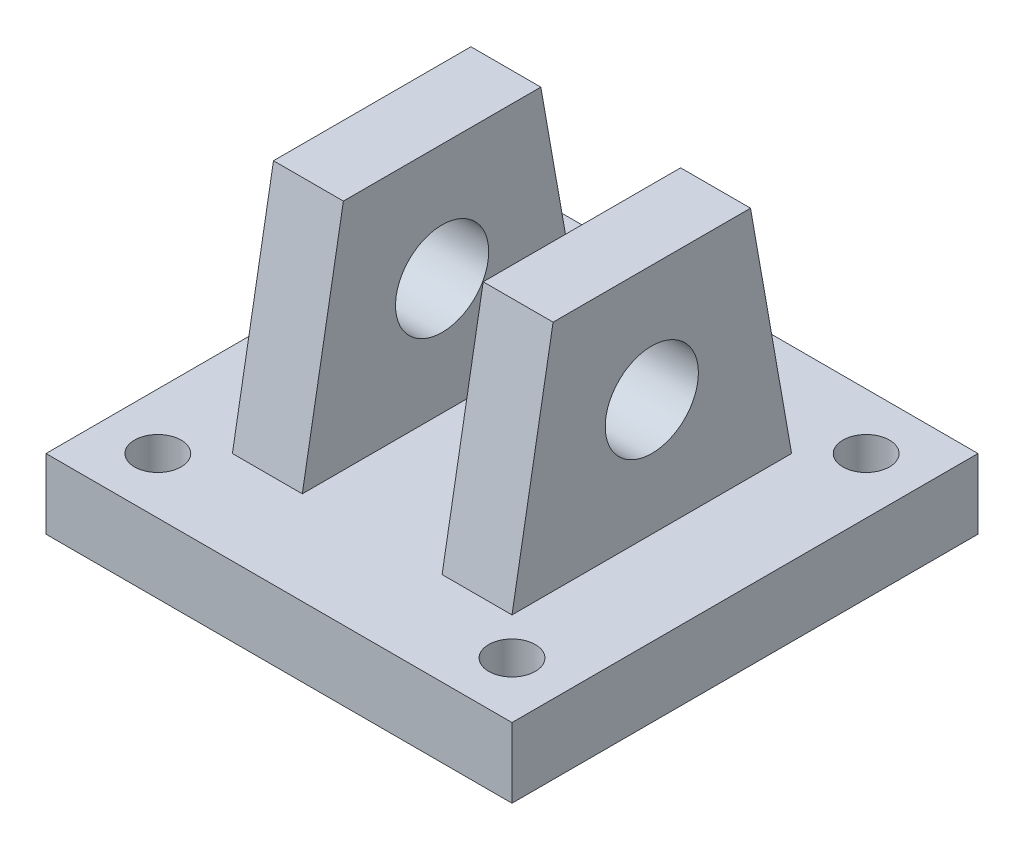
ISO-10303-21;
HEADER;
FILE_DESCRIPTION(('STEP AP214'),'2;1');
FILE_NAME('part.step','',(''),(''),'','','');
FILE_SCHEMA(('AUTOMOTIVE_DESIGN { 1 0 10303 214 1 1 1 1 }'));
ENDSEC;
DATA;
#1=APPLICATION_CONTEXT('core data for automotive mechanical design processes');
#2=APPLICATION_PROTOCOL_DEFINITION('international standard','automotive_design',2000,#1);
#3=PRODUCT_CONTEXT('',#1,'mechanical');
#4=PRODUCT('Part','Part','',(#3));
#5=PRODUCT_RELATED_PRODUCT_CATEGORY('part','',(#4));
#6=PRODUCT_DEFINITION_FORMATION('','',#4);
#7=PRODUCT_DEFINITION_CONTEXT('part definition',#1,'design');
#8=PRODUCT_DEFINITION('design','',#6,#7);
#9=PRODUCT_DEFINITION_SHAPE('','',#8);
#10=(LENGTH_UNIT() NAMED_UNIT(*) SI_UNIT(.MILLI.,.METRE.));
#11=(NAMED_UNIT(*) PLANE_ANGLE_UNIT() SI_UNIT($,.RADIAN.));
#12=(NAMED_UNIT(*) SI_UNIT($,.STERADIAN.) SOLID_ANGLE_UNIT());
#13=UNCERTAINTY_MEASURE_WITH_UNIT(LENGTH_MEASURE(1.E-05),#10,'distance_accuracy_value','');
#14=(GEOMETRIC_REPRESENTATION_CONTEXT(3) GLOBAL_UNCERTAINTY_ASSIGNED_CONTEXT((#13)) GLOBAL_UNIT_ASSIGNED_CONTEXT((#10,
#11,#12)) REPRESENTATION_CONTEXT('',''));
#15=CARTESIAN_POINT('',(0.,0.,0.));
#16=DIRECTION('',(0.,0.,1.));
#17=DIRECTION('',(1.,0.,0.));
#18=AXIS2_PLACEMENT_3D('',#15,#16,#17);
#19=CARTESIAN_POINT('',(38.1,0.,-38.1));
#20=DIRECTION('',(0.,-0.173648177666934,0.984807753012207));
#21=DIRECTION('',(0.,-0.984807753012207,-0.173648177666934));
#22=AXIS2_PLACEMENT_3D('',#19,#20,#21);
#23=PLANE('',#22);
#24=DIRECTION('',(-1.,0.,0.));
#25=VECTOR('',#24,1.);
#26=CARTESIAN_POINT('',(38.1,63.5,-26.9032367250122));
#27=LINE('',#26,#25);
#28=CARTESIAN_POINT('',(-19.05,63.5,-26.9032367250122));
#29=VERTEX_POINT('',#28);
#30=CARTESIAN_POINT('',(-38.1,63.5,-26.9032367250122));
#31=VERTEX_POINT('',#30);
#32=EDGE_CURVE('E157',#29,#31,#27,.T.);
#33=ORIENTED_EDGE('',*,*,#32,.F.);
#34=DIRECTION('',(0.,-0.984807753012208,-0.173648177666934));
#35=VECTOR('',#34,1.);
#36=CARTESIAN_POINT('',(-19.05,0.,-38.1));
#37=LINE('',#36,#35);
#38=CARTESIAN_POINT('',(-19.05,0.,-38.1));
#39=VERTEX_POINT('',#38);
#40=EDGE_CURVE('E208',#29,#39,#37,.T.);
#41=ORIENTED_EDGE('',*,*,#40,.T.);
#42=DIRECTION('',(-1.,0.,0.));
#43=VECTOR('',#42,1.);
#44=CARTESIAN_POINT('',(38.1,0.,-38.1));
#45=LINE('',#44,#43);
#46=CARTESIAN_POINT('',(-38.1,0.,-38.1));
#47=VERTEX_POINT('',#46);
#48=EDGE_CURVE('E56',#39,#47,#45,.T.);
#49=ORIENTED_EDGE('',*,*,#48,.T.);
#50=DIRECTION('',(0.,0.984807753012207,0.173648177666934));
#51=VECTOR('',#50,1.);
#52=CARTESIAN_POINT('',(-38.1,0.,-38.1));
#53=LINE('',#52,#51);
#54=EDGE_CURVE('E219',#47,#31,#53,.T.);
#55=ORIENTED_EDGE('',*,*,#54,.T.);
#56=EDGE_LOOP('',(#33,#41,#49,#55));
#57=FACE_BOUND('',#56,.T.);
#58=ADVANCED_FACE('F32',(#57),#23,.F.);
#59=CARTESIAN_POINT('',(38.1,63.5,-26.9032367250122));
#60=DIRECTION('',(0.,-1.,0.));
#61=DIRECTION('',(0.,0.,-1.));
#62=AXIS2_PLACEMENT_3D('',#59,#60,#61);
#63=PLANE('',#62);
#64=DIRECTION('',(-1.,0.,0.));
#65=VECTOR('',#64,1.);
#66=CARTESIAN_POINT('',(38.1,63.5,26.9032367250122));
#67=LINE('',#66,#65);
#68=CARTESIAN_POINT('',(-19.05,63.5,26.9032367250122));
#69=VERTEX_POINT('',#68);
#70=CARTESIAN_POINT('',(-38.1,63.5,26.9032367250122));
#71=VERTEX_POINT('',#70);
#72=EDGE_CURVE('E149',#69,#71,#67,.T.);
#73=ORIENTED_EDGE('',*,*,#72,.F.);
#74=DIRECTION('',(0.,0.,1.));
#75=VECTOR('',#74,1.);
#76=CARTESIAN_POINT('',(-19.05,63.5,-38.1));
#77=LINE('',#76,#75);
#78=EDGE_CURVE('E192',#29,#69,#77,.T.);
#79=ORIENTED_EDGE('',*,*,#78,.F.);
#80=ORIENTED_EDGE('',*,*,#32,.T.);
#81=DIRECTION('',(0.,0.,1.));
#82=VECTOR('',#81,1.);
#83=CARTESIAN_POINT('',(-38.1,63.5,-26.9032367250122));
#84=LINE('',#83,#82);
#85=EDGE_CURVE('E221',#31,#71,#84,.T.);
#86=ORIENTED_EDGE('',*,*,#85,.T.);
#87=EDGE_LOOP('',(#73,#79,#80,#86));
#88=FACE_BOUND('',#87,.T.);
#89=ADVANCED_FACE('F240',(#88),#63,.F.);
#90=CARTESIAN_POINT('',(38.1,63.5,26.9032367250122));
#91=DIRECTION('',(0.,-0.173648177666934,-0.984807753012207));
#92=DIRECTION('',(0.,0.984807753012207,-0.173648177666934));
#93=AXIS2_PLACEMENT_3D('',#90,#91,#92);
#94=PLANE('',#93);
#95=DIRECTION('',(-1.,0.,0.));
#96=VECTOR('',#95,1.);
#97=CARTESIAN_POINT('',(38.1,0.,38.1));
#98=LINE('',#97,#96);
#99=CARTESIAN_POINT('',(-19.05,0.,38.1));
#100=VERTEX_POINT('',#99);
#101=CARTESIAN_POINT('',(-38.1,0.,38.1));
#102=VERTEX_POINT('',#101);
#103=EDGE_CURVE('E150',#100,#102,#98,.T.);
#104=ORIENTED_EDGE('',*,*,#103,.F.);
#105=DIRECTION('',(0.,0.984807753012208,-0.173648177666934));
#106=VECTOR('',#105,1.);
#107=CARTESIAN_POINT('',(-19.05,63.5,26.9032367250122));
#108=LINE('',#107,#106);
#109=EDGE_CURVE('E206',#100,#69,#108,.T.);
#110=ORIENTED_EDGE('',*,*,#109,.T.);
#111=ORIENTED_EDGE('',*,*,#72,.T.);
#112=DIRECTION('',(0.,-0.984807753012207,0.173648177666934));
#113=VECTOR('',#112,1.);
#114=CARTESIAN_POINT('',(-38.1,63.5,26.9032367250122));
#115=LINE('',#114,#113);
#116=EDGE_CURVE('E224',#71,#102,#115,.T.);
#117=ORIENTED_EDGE('',*,*,#116,.T.);
#118=EDGE_LOOP('',(#104,#110,#111,#117));
#119=FACE_BOUND('',#118,.T.);
#120=ADVANCED_FACE('F246',(#119),#94,.F.);
#121=CARTESIAN_POINT('',(-38.1,31.75,0.));
#122=DIRECTION('',(1.,0.,0.));
#123=DIRECTION('',(0.,0.,-1.));
#124=AXIS2_PLACEMENT_3D('',#121,#122,#123);
#125=CYLINDRICAL_SURFACE('',#124,12.7);
#126=CARTESIAN_POINT('',(-19.05,31.75,0.));
#127=DIRECTION('',(-1.,0.,0.));
#128=DIRECTION('',(0.,-1.,0.));
#129=AXIS2_PLACEMENT_3D('',#126,#127,#128);
#130=CIRCLE('',#129,12.7);
#131=CARTESIAN_POINT('',(-19.05,19.05,0.));
#132=VERTEX_POINT('',#131);
#133=EDGE_CURVE('E36',#132,#132,#130,.F.);
#134=ORIENTED_EDGE('',*,*,#133,.T.);
#135=EDGE_LOOP('',(#134));
#136=FACE_BOUND('',#135,.T.);
#137=CARTESIAN_POINT('',(-38.1,31.75,0.));
#138=DIRECTION('',(1.,0.,0.));
#139=DIRECTION('',(0.,0.,-1.));
#140=AXIS2_PLACEMENT_3D('',#137,#138,#139);
#141=CIRCLE('',#140,12.7);
#142=CARTESIAN_POINT('',(-38.1,31.75,-12.7));
#143=VERTEX_POINT('',#142);
#144=EDGE_CURVE('E213',#143,#143,#141,.T.);
#145=ORIENTED_EDGE('',*,*,#144,.F.);
#146=EDGE_LOOP('',(#145));
#147=FACE_BOUND('',#146,.T.);
#148=ADVANCED_FACE('F286',(#136,#147),#125,.F.);
#149=CARTESIAN_POINT('',(-63.5,-19.05,-63.5));
#150=DIRECTION('',(-1.,0.,0.));
#151=DIRECTION('',(0.,0.,1.));
#152=AXIS2_PLACEMENT_3D('',#149,#150,#151);
#153=PLANE('',#152);
#154=DIRECTION('',(0.,0.,1.));
#155=VECTOR('',#154,1.);
#156=CARTESIAN_POINT('',(-63.5,0.,-63.5));
#157=LINE('',#156,#155);
#158=CARTESIAN_POINT('',(-63.5,0.,-63.5));
#159=VERTEX_POINT('',#158);
#160=CARTESIAN_POINT('',(-63.5,0.,63.5));
#161=VERTEX_POINT('',#160);
#162=EDGE_CURVE('E163',#159,#161,#157,.T.);
#163=ORIENTED_EDGE('',*,*,#162,.F.);
#164=DIRECTION('',(0.,1.,0.));
#165=VECTOR('',#164,1.);
#166=CARTESIAN_POINT('',(-63.5,-19.05,-63.5));
#167=LINE('',#166,#165);
#168=CARTESIAN_POINT('',(-63.5,-19.05,-63.5));
#169=VERTEX_POINT('',#168);
#170=EDGE_CURVE('E11',#169,#159,#167,.T.);
#171=ORIENTED_EDGE('',*,*,#170,.F.);
#172=DIRECTION('',(0.,0.,1.));
#173=VECTOR('',#172,1.);
#174=CARTESIAN_POINT('',(-63.5,-19.05,-63.5));
#175=LINE('',#174,#173);
#176=CARTESIAN_POINT('',(-63.5,-19.05,63.5));
#177=VERTEX_POINT('',#176);
#178=EDGE_CURVE('E175',#169,#177,#175,.T.);
#179=ORIENTED_EDGE('',*,*,#178,.T.);
#180=DIRECTION('',(0.,1.,0.));
#181=VECTOR('',#180,1.);
#182=CARTESIAN_POINT('',(-63.5,-19.05,63.5));
#183=LINE('',#182,#181);
#184=EDGE_CURVE('E186',#177,#161,#183,.T.);
#185=ORIENTED_EDGE('',*,*,#184,.T.);
#186=EDGE_LOOP('',(#163,#171,#179,#185));
#187=FACE_BOUND('',#186,.T.);
#188=ADVANCED_FACE('F34',(#187),#153,.T.);
#189=CARTESIAN_POINT('',(-63.5,-19.05,-63.5));
#190=DIRECTION('',(0.,0.,-1.));
#191=DIRECTION('',(-1.,0.,0.));
#192=AXIS2_PLACEMENT_3D('',#189,#190,#191);
#193=PLANE('',#192);
#194=DIRECTION('',(-1.,0.,0.));
#195=VECTOR('',#194,1.);
#196=CARTESIAN_POINT('',(-63.5,0.,-63.5));
#197=LINE('',#196,#195);
#198=CARTESIAN_POINT('',(63.5,0.,-63.5));
#199=VERTEX_POINT('',#198);
#200=EDGE_CURVE('E172',#199,#159,#197,.T.);
#201=ORIENTED_EDGE('',*,*,#200,.F.);
#202=DIRECTION('',(0.,1.,0.));
#203=VECTOR('',#202,1.);
#204=CARTESIAN_POINT('',(63.5,-19.05,-63.5));
#205=LINE('',#204,#203);
#206=CARTESIAN_POINT('',(63.5,-19.05,-63.5));
#207=VERTEX_POINT('',#206);
#208=EDGE_CURVE('E41',#207,#199,#205,.T.);
#209=ORIENTED_EDGE('',*,*,#208,.F.);
#210=DIRECTION('',(-1.,0.,0.));
#211=VECTOR('',#210,1.);
#212=CARTESIAN_POINT('',(-63.5,-19.05,-63.5));
#213=LINE('',#212,#211);
#214=EDGE_CURVE('E184',#207,#169,#213,.T.);
#215=ORIENTED_EDGE('',*,*,#214,.T.);
#216=ORIENTED_EDGE('',*,*,#170,.T.);
#217=EDGE_LOOP('',(#201,#209,#215,#216));
#218=FACE_BOUND('',#217,.T.);
#219=ADVANCED_FACE('F263',(#218),#193,.T.);
#220=CARTESIAN_POINT('',(63.5,-19.05,-63.5));
#221=DIRECTION('',(1.,0.,0.));
#222=DIRECTION('',(0.,0.,-1.));
#223=AXIS2_PLACEMENT_3D('',#220,#221,#222);
#224=PLANE('',#223);
#225=DIRECTION('',(0.,0.,-1.));
#226=VECTOR('',#225,1.);
#227=CARTESIAN_POINT('',(63.5,0.,-63.5));
#228=LINE('',#227,#226);
#229=CARTESIAN_POINT('',(63.5,0.,63.5));
#230=VERTEX_POINT('',#229);
#231=EDGE_CURVE('E169',#230,#199,#228,.T.);
#232=ORIENTED_EDGE('',*,*,#231,.F.);
#233=DIRECTION('',(0.,1.,0.));
#234=VECTOR('',#233,1.);
#235=CARTESIAN_POINT('',(63.5,-19.05,63.5));
#236=LINE('',#235,#234);
#237=CARTESIAN_POINT('',(63.5,-19.05,63.5));
#238=VERTEX_POINT('',#237);
#239=EDGE_CURVE('E189',#238,#230,#236,.T.);
#240=ORIENTED_EDGE('',*,*,#239,.F.);
#241=DIRECTION('',(0.,0.,-1.));
#242=VECTOR('',#241,1.);
#243=CARTESIAN_POINT('',(63.5,-19.05,-63.5));
#244=LINE('',#243,#242);
#245=EDGE_CURVE('E181',#238,#207,#244,.T.);
#246=ORIENTED_EDGE('',*,*,#245,.T.);
#247=ORIENTED_EDGE('',*,*,#208,.T.);
#248=EDGE_LOOP('',(#232,#240,#246,#247));
#249=FACE_BOUND('',#248,.T.);
#250=ADVANCED_FACE('F266',(#249),#224,.T.);
#251=CARTESIAN_POINT('',(-63.5,-19.05,63.5));
#252=DIRECTION('',(0.,0.,1.));
#253=DIRECTION('',(1.,0.,0.));
#254=AXIS2_PLACEMENT_3D('',#251,#252,#253);
#255=PLANE('',#254);
#256=DIRECTION('',(1.,0.,0.));
#257=VECTOR('',#256,1.);
#258=CARTESIAN_POINT('',(-63.5,0.,63.5));
#259=LINE('',#258,#257);
#260=EDGE_CURVE('E166',#161,#230,#259,.T.);
#261=ORIENTED_EDGE('',*,*,#260,.F.);
#262=ORIENTED_EDGE('',*,*,#184,.F.);
#263=DIRECTION('',(1.,0.,0.));
#264=VECTOR('',#263,1.);
#265=CARTESIAN_POINT('',(-63.5,-19.05,63.5));
#266=LINE('',#265,#264);
#267=EDGE_CURVE('E178',#177,#238,#266,.T.);
#268=ORIENTED_EDGE('',*,*,#267,.T.);
#269=ORIENTED_EDGE('',*,*,#239,.T.);
#270=EDGE_LOOP('',(#261,#262,#268,#269));
#271=FACE_BOUND('',#270,.T.);
#272=ADVANCED_FACE('F261',(#271),#255,.T.);
#273=CARTESIAN_POINT('',(-63.5,-19.05,63.5));
#274=DIRECTION('',(0.,1.,0.));
#275=DIRECTION('',(0.,0.,1.));
#276=AXIS2_PLACEMENT_3D('',#273,#274,#275);
#277=PLANE('',#276);
#278=CARTESIAN_POINT('',(48.26,-19.05,48.26));
#279=DIRECTION('',(0.,1.,0.));
#280=DIRECTION('',(0.,0.,1.));
#281=AXIS2_PLACEMENT_3D('',#278,#279,#280);
#282=CIRCLE('',#281,6.35);
#283=CARTESIAN_POINT('',(48.26,-19.05,54.61));
#284=VERTEX_POINT('',#283);
#285=EDGE_CURVE('E440',#284,#284,#282,.F.);
#286=ORIENTED_EDGE('',*,*,#285,.F.);
#287=EDGE_LOOP('',(#286));
#288=FACE_BOUND('',#287,.T.);
#289=CARTESIAN_POINT('',(-48.26,-19.05,48.26));
#290=DIRECTION('',(0.,1.,0.));
#291=DIRECTION('',(0.,0.,1.));
#292=AXIS2_PLACEMENT_3D('',#289,#290,#291);
#293=CIRCLE('',#292,6.35);
#294=CARTESIAN_POINT('',(-48.26,-19.05,54.61));
#295=VERTEX_POINT('',#294);
#296=EDGE_CURVE('E444',#295,#295,#293,.F.);
#297=ORIENTED_EDGE('',*,*,#296,.F.);
#298=EDGE_LOOP('',(#297));
#299=FACE_BOUND('',#298,.T.);
#300=CARTESIAN_POINT('',(48.26,-19.05,-48.26));
#301=DIRECTION('',(0.,1.,0.));
#302=DIRECTION('',(0.,0.,1.));
#303=AXIS2_PLACEMENT_3D('',#300,#301,#302);
#304=CIRCLE('',#303,6.35);
#305=CARTESIAN_POINT('',(48.26,-19.05,-41.91));
#306=VERTEX_POINT('',#305);
#307=EDGE_CURVE('E453',#306,#306,#304,.F.);
#308=ORIENTED_EDGE('',*,*,#307,.F.);
#309=EDGE_LOOP('',(#308));
#310=FACE_BOUND('',#309,.T.);
#311=CARTESIAN_POINT('',(-48.26,-19.05,-48.26));
#312=DIRECTION('',(0.,1.,0.));
#313=DIRECTION('',(0.,0.,1.));
#314=AXIS2_PLACEMENT_3D('',#311,#312,#313);
#315=CIRCLE('',#314,6.35);
#316=CARTESIAN_POINT('',(-48.26,-19.05,-41.91));
#317=VERTEX_POINT('',#316);
#318=EDGE_CURVE('E201',#317,#317,#315,.F.);
#319=ORIENTED_EDGE('',*,*,#318,.F.);
#320=EDGE_LOOP('',(#319));
#321=FACE_BOUND('',#320,.T.);
#322=ORIENTED_EDGE('',*,*,#178,.F.);
#323=ORIENTED_EDGE('',*,*,#214,.F.);
#324=ORIENTED_EDGE('',*,*,#245,.F.);
#325=ORIENTED_EDGE('',*,*,#267,.F.);
#326=EDGE_LOOP('',(#322,#323,#324,#325));
#327=FACE_BOUND('',#326,.T.);
#328=ADVANCED_FACE('F257',(#288,#299,#310,#321,#327),#277,.F.);
#329=CARTESIAN_POINT('',(-63.5,0.,63.5));
#330=DIRECTION('',(0.,1.,0.));
#331=DIRECTION('',(0.,0.,1.));
#332=AXIS2_PLACEMENT_3D('',#329,#330,#331);
#333=PLANE('',#332);
#334=CARTESIAN_POINT('',(48.26,0.,48.26));
#335=DIRECTION('',(0.,1.,0.));
#336=DIRECTION('',(0.,0.,1.));
#337=AXIS2_PLACEMENT_3D('',#334,#335,#336);
#338=CIRCLE('',#337,6.35);
#339=CARTESIAN_POINT('',(48.26,0.,54.61));
#340=VERTEX_POINT('',#339);
#341=EDGE_CURVE('E437',#340,#340,#338,.T.);
#342=ORIENTED_EDGE('',*,*,#341,.F.);
#343=EDGE_LOOP('',(#342));
#344=FACE_BOUND('',#343,.T.);
#345=CARTESIAN_POINT('',(-48.26,0.,48.26));
#346=DIRECTION('',(0.,1.,0.));
#347=DIRECTION('',(0.,0.,1.));
#348=AXIS2_PLACEMENT_3D('',#345,#346,#347);
#349=CIRCLE('',#348,6.35);
#350=CARTESIAN_POINT('',(-48.26,0.,54.61));
#351=VERTEX_POINT('',#350);
#352=EDGE_CURVE('E441',#351,#351,#349,.T.);
#353=ORIENTED_EDGE('',*,*,#352,.F.);
#354=EDGE_LOOP('',(#353));
#355=FACE_BOUND('',#354,.T.);
#356=CARTESIAN_POINT('',(48.26,0.,-48.26));
#357=DIRECTION('',(0.,1.,0.));
#358=DIRECTION('',(0.,0.,1.));
#359=AXIS2_PLACEMENT_3D('',#356,#357,#358);
#360=CIRCLE('',#359,6.35);
#361=CARTESIAN_POINT('',(48.26,0.,-41.91));
#362=VERTEX_POINT('',#361);
#363=EDGE_CURVE('E450',#362,#362,#360,.T.);
#364=ORIENTED_EDGE('',*,*,#363,.F.);
#365=EDGE_LOOP('',(#364));
#366=FACE_BOUND('',#365,.T.);
#367=CARTESIAN_POINT('',(-48.26,0.,-48.26));
#368=DIRECTION('',(0.,1.,0.));
#369=DIRECTION('',(0.,0.,1.));
#370=AXIS2_PLACEMENT_3D('',#367,#368,#369);
#371=CIRCLE('',#370,6.35);
#372=CARTESIAN_POINT('',(-48.26,0.,-41.91));
#373=VERTEX_POINT('',#372);
#374=EDGE_CURVE('E455',#373,#373,#371,.T.);
#375=ORIENTED_EDGE('',*,*,#374,.F.);
#376=EDGE_LOOP('',(#375));
#377=FACE_BOUND('',#376,.T.);
#378=DIRECTION('',(0.,0.,1.));
#379=VECTOR('',#378,1.);
#380=CARTESIAN_POINT('',(19.05,0.,-38.1));
#381=LINE('',#380,#379);
#382=CARTESIAN_POINT('',(19.05,0.,-38.1));
#383=VERTEX_POINT('',#382);
#384=CARTESIAN_POINT('',(19.05,0.,38.1));
#385=VERTEX_POINT('',#384);
#386=EDGE_CURVE('E122',#383,#385,#381,.T.);
#387=ORIENTED_EDGE('',*,*,#386,.F.);
#388=CARTESIAN_POINT('',(38.1,0.,-38.1));
#389=VERTEX_POINT('',#388);
#390=EDGE_CURVE('E161',#389,#383,#45,.T.);
#391=ORIENTED_EDGE('',*,*,#390,.F.);
#392=DIRECTION('',(0.,0.,-1.));
#393=VECTOR('',#392,1.);
#394=CARTESIAN_POINT('',(38.1,0.,38.1));
#395=LINE('',#394,#393);
#396=CARTESIAN_POINT('',(38.1,0.,38.1));
#397=VERTEX_POINT('',#396);
#398=EDGE_CURVE('E148',#397,#389,#395,.T.);
#399=ORIENTED_EDGE('',*,*,#398,.F.);
#400=EDGE_CURVE('E140',#397,#385,#98,.T.);
#401=ORIENTED_EDGE('',*,*,#400,.T.);
#402=EDGE_LOOP('',(#387,#391,#399,#401));
#403=FACE_BOUND('',#402,.T.);
#404=ORIENTED_EDGE('',*,*,#48,.F.);
#405=DIRECTION('',(0.,0.,1.));
#406=VECTOR('',#405,1.);
#407=CARTESIAN_POINT('',(-19.05,0.,-38.1));
#408=LINE('',#407,#406);
#409=EDGE_CURVE('E49',#39,#100,#408,.T.);
#410=ORIENTED_EDGE('',*,*,#409,.T.);
#411=ORIENTED_EDGE('',*,*,#103,.T.);
#412=DIRECTION('',(0.,0.,-1.));
#413=VECTOR('',#412,1.);
#414=CARTESIAN_POINT('',(-38.1,0.,38.1));
#415=LINE('',#414,#413);
#416=EDGE_CURVE('E216',#102,#47,#415,.T.);
#417=ORIENTED_EDGE('',*,*,#416,.T.);
#418=EDGE_LOOP('',(#404,#410,#411,#417));
#419=FACE_BOUND('',#418,.T.);
#420=ORIENTED_EDGE('',*,*,#162,.T.);
#421=ORIENTED_EDGE('',*,*,#260,.T.);
#422=ORIENTED_EDGE('',*,*,#231,.T.);
#423=ORIENTED_EDGE('',*,*,#200,.T.);
#424=EDGE_LOOP('',(#420,#421,#422,#423));
#425=FACE_BOUND('',#424,.T.);
#426=ADVANCED_FACE('F146',(#344,#355,#366,#377,#403,#419,#425),#333,.T.);
#427=ORIENTED_EDGE('',*,*,#390,.T.);
#428=DIRECTION('',(0.,0.984807753012208,0.173648177666934));
#429=VECTOR('',#428,1.);
#430=CARTESIAN_POINT('',(19.05,0.,-38.1));
#431=LINE('',#430,#429);
#432=CARTESIAN_POINT('',(19.05,63.5,-26.9032367250122));
#433=VERTEX_POINT('',#432);
#434=EDGE_CURVE('E128',#383,#433,#431,.T.);
#435=ORIENTED_EDGE('',*,*,#434,.T.);
#436=CARTESIAN_POINT('',(38.1,63.5,-26.9032367250122));
#437=VERTEX_POINT('',#436);
#438=EDGE_CURVE('E158',#437,#433,#27,.T.);
#439=ORIENTED_EDGE('',*,*,#438,.F.);
#440=DIRECTION('',(0.,0.984807753012207,0.173648177666934));
#441=VECTOR('',#440,1.);
#442=CARTESIAN_POINT('',(38.1,0.,-38.1));
#443=LINE('',#442,#441);
#444=EDGE_CURVE('E228',#389,#437,#443,.T.);
#445=ORIENTED_EDGE('',*,*,#444,.F.);
#446=EDGE_LOOP('',(#427,#435,#439,#445));
#447=FACE_BOUND('',#446,.T.);
#448=ADVANCED_FACE('F235',(#447),#23,.F.);
#449=ORIENTED_EDGE('',*,*,#438,.T.);
#450=DIRECTION('',(0.,0.,1.));
#451=VECTOR('',#450,1.);
#452=CARTESIAN_POINT('',(19.05,63.5,-38.1));
#453=LINE('',#452,#451);
#454=CARTESIAN_POINT('',(19.05,63.5,26.9032367250122));
#455=VERTEX_POINT('',#454);
#456=EDGE_CURVE('E133',#433,#455,#453,.T.);
#457=ORIENTED_EDGE('',*,*,#456,.T.);
#458=CARTESIAN_POINT('',(38.1,63.5,26.9032367250122));
#459=VERTEX_POINT('',#458);
#460=EDGE_CURVE('E143',#459,#455,#67,.T.);
#461=ORIENTED_EDGE('',*,*,#460,.F.);
#462=DIRECTION('',(0.,0.,1.));
#463=VECTOR('',#462,1.);
#464=CARTESIAN_POINT('',(38.1,63.5,-26.9032367250122));
#465=LINE('',#464,#463);
#466=EDGE_CURVE('E229',#437,#459,#465,.T.);
#467=ORIENTED_EDGE('',*,*,#466,.F.);
#468=EDGE_LOOP('',(#449,#457,#461,#467));
#469=FACE_BOUND('',#468,.T.);
#470=ADVANCED_FACE('F237',(#469),#63,.F.);
#471=ORIENTED_EDGE('',*,*,#460,.T.);
#472=DIRECTION('',(0.,-0.984807753012208,0.173648177666934));
#473=VECTOR('',#472,1.);
#474=CARTESIAN_POINT('',(19.05,63.5,26.9032367250122));
#475=LINE('',#474,#473);
#476=EDGE_CURVE('E125',#455,#385,#475,.T.);
#477=ORIENTED_EDGE('',*,*,#476,.T.);
#478=ORIENTED_EDGE('',*,*,#400,.F.);
#479=DIRECTION('',(0.,-0.984807753012207,0.173648177666934));
#480=VECTOR('',#479,1.);
#481=CARTESIAN_POINT('',(38.1,63.5,26.9032367250122));
#482=LINE('',#481,#480);
#483=EDGE_CURVE('E153',#459,#397,#482,.T.);
#484=ORIENTED_EDGE('',*,*,#483,.F.);
#485=EDGE_LOOP('',(#471,#477,#478,#484));
#486=FACE_BOUND('',#485,.T.);
#487=ADVANCED_FACE('F138',(#486),#94,.F.);
#488=CARTESIAN_POINT('',(38.1,0.,-38.1));
#489=DIRECTION('',(1.,0.,0.));
#490=DIRECTION('',(0.,0.,-1.));
#491=AXIS2_PLACEMENT_3D('',#488,#489,#490);
#492=PLANE('',#491);
#493=CARTESIAN_POINT('',(38.1,31.75,0.));
#494=DIRECTION('',(1.,0.,0.));
#495=DIRECTION('',(0.,0.,-1.));
#496=AXIS2_PLACEMENT_3D('',#493,#494,#495);
#497=CIRCLE('',#496,12.7);
#498=CARTESIAN_POINT('',(38.1,31.75,-12.7));
#499=VERTEX_POINT('',#498);
#500=EDGE_CURVE('E210',#499,#499,#497,.T.);
#501=ORIENTED_EDGE('',*,*,#500,.F.);
#502=EDGE_LOOP('',(#501));
#503=FACE_BOUND('',#502,.T.);
#504=ORIENTED_EDGE('',*,*,#398,.T.);
#505=ORIENTED_EDGE('',*,*,#444,.T.);
#506=ORIENTED_EDGE('',*,*,#466,.T.);
#507=ORIENTED_EDGE('',*,*,#483,.T.);
#508=EDGE_LOOP('',(#504,#505,#506,#507));
#509=FACE_BOUND('',#508,.T.);
#510=ADVANCED_FACE('F232',(#503,#509),#492,.T.);
#511=CARTESIAN_POINT('',(-38.1,0.,-38.1));
#512=DIRECTION('',(1.,0.,0.));
#513=DIRECTION('',(0.,0.,-1.));
#514=AXIS2_PLACEMENT_3D('',#511,#512,#513);
#515=PLANE('',#514);
#516=ORIENTED_EDGE('',*,*,#144,.T.);
#517=EDGE_LOOP('',(#516));
#518=FACE_BOUND('',#517,.T.);
#519=ORIENTED_EDGE('',*,*,#416,.F.);
#520=ORIENTED_EDGE('',*,*,#116,.F.);
#521=ORIENTED_EDGE('',*,*,#85,.F.);
#522=ORIENTED_EDGE('',*,*,#54,.F.);
#523=EDGE_LOOP('',(#519,#520,#521,#522));
#524=FACE_BOUND('',#523,.T.);
#525=ADVANCED_FACE('F303',(#518,#524),#515,.F.);
#526=CARTESIAN_POINT('',(19.05,31.75,0.));
#527=DIRECTION('',(1.,0.,0.));
#528=DIRECTION('',(0.,1.,0.));
#529=AXIS2_PLACEMENT_3D('',#526,#527,#528);
#530=CIRCLE('',#529,12.7);
#531=CARTESIAN_POINT('',(19.05,44.45,0.));
#532=VERTEX_POINT('',#531);
#533=EDGE_CURVE('E144',#532,#532,#530,.F.);
#534=ORIENTED_EDGE('',*,*,#533,.T.);
#535=EDGE_LOOP('',(#534));
#536=FACE_BOUND('',#535,.T.);
#537=ORIENTED_EDGE('',*,*,#500,.T.);
#538=EDGE_LOOP('',(#537));
#539=FACE_BOUND('',#538,.T.);
#540=ADVANCED_FACE('F292',(#536,#539),#125,.F.);
#541=CARTESIAN_POINT('',(-19.05,63.5,-38.1));
#542=DIRECTION('',(-1.,0.,0.));
#543=DIRECTION('',(0.,-1.,0.));
#544=AXIS2_PLACEMENT_3D('',#541,#542,#543);
#545=PLANE('',#544);
#546=ORIENTED_EDGE('',*,*,#133,.F.);
#547=EDGE_LOOP('',(#546));
#548=FACE_BOUND('',#547,.T.);
#549=ORIENTED_EDGE('',*,*,#78,.T.);
#550=ORIENTED_EDGE('',*,*,#109,.F.);
#551=ORIENTED_EDGE('',*,*,#409,.F.);
#552=ORIENTED_EDGE('',*,*,#40,.F.);
#553=EDGE_LOOP('',(#549,#550,#551,#552));
#554=FACE_BOUND('',#553,.T.);
#555=ADVANCED_FACE('F302',(#548,#554),#545,.F.);
#556=CARTESIAN_POINT('',(19.05,63.5,-38.1));
#557=DIRECTION('',(1.,0.,0.));
#558=DIRECTION('',(0.,1.,0.));
#559=AXIS2_PLACEMENT_3D('',#556,#557,#558);
#560=PLANE('',#559);
#561=ORIENTED_EDGE('',*,*,#533,.F.);
#562=EDGE_LOOP('',(#561));
#563=FACE_BOUND('',#562,.T.);
#564=ORIENTED_EDGE('',*,*,#386,.T.);
#565=ORIENTED_EDGE('',*,*,#476,.F.);
#566=ORIENTED_EDGE('',*,*,#456,.F.);
#567=ORIENTED_EDGE('',*,*,#434,.F.);
#568=EDGE_LOOP('',(#564,#565,#566,#567));
#569=FACE_BOUND('',#568,.T.);
#570=ADVANCED_FACE('F124',(#563,#569),#560,.F.);
#571=CARTESIAN_POINT('',(-48.26,-19.051,-48.26));
#572=DIRECTION('',(0.,1.,0.));
#573=DIRECTION('',(0.,0.,1.));
#574=AXIS2_PLACEMENT_3D('',#571,#572,#573);
#575=CYLINDRICAL_SURFACE('',#574,6.35);
#576=ORIENTED_EDGE('',*,*,#374,.T.);
#577=EDGE_LOOP('',(#576));
#578=FACE_BOUND('',#577,.T.);
#579=ORIENTED_EDGE('',*,*,#318,.T.);
#580=EDGE_LOOP('',(#579));
#581=FACE_BOUND('',#580,.T.);
#582=ADVANCED_FACE('F378',(#578,#581),#575,.F.);
#583=CARTESIAN_POINT('',(48.26,-19.051,-48.26));
#584=DIRECTION('',(0.,1.,0.));
#585=DIRECTION('',(0.,0.,1.));
#586=AXIS2_PLACEMENT_3D('',#583,#584,#585);
#587=CYLINDRICAL_SURFACE('',#586,6.35);
#588=ORIENTED_EDGE('',*,*,#363,.T.);
#589=EDGE_LOOP('',(#588));
#590=FACE_BOUND('',#589,.T.);
#591=ORIENTED_EDGE('',*,*,#307,.T.);
#592=EDGE_LOOP('',(#591));
#593=FACE_BOUND('',#592,.T.);
#594=ADVANCED_FACE('F388',(#590,#593),#587,.F.);
#595=CARTESIAN_POINT('',(-48.26,-19.051,48.26));
#596=DIRECTION('',(0.,1.,0.));
#597=DIRECTION('',(0.,0.,1.));
#598=AXIS2_PLACEMENT_3D('',#595,#596,#597);
#599=CYLINDRICAL_SURFACE('',#598,6.35);
#600=ORIENTED_EDGE('',*,*,#352,.T.);
#601=EDGE_LOOP('',(#600));
#602=FACE_BOUND('',#601,.T.);
#603=ORIENTED_EDGE('',*,*,#296,.T.);
#604=EDGE_LOOP('',(#603));
#605=FACE_BOUND('',#604,.T.);
#606=ADVANCED_FACE('F398',(#602,#605),#599,.F.);
#607=CARTESIAN_POINT('',(48.26,-19.051,48.26));
#608=DIRECTION('',(0.,1.,0.));
#609=DIRECTION('',(0.,0.,1.));
#610=AXIS2_PLACEMENT_3D('',#607,#608,#609);
#611=CYLINDRICAL_SURFACE('',#610,6.35);
#612=ORIENTED_EDGE('',*,*,#341,.T.);
#613=EDGE_LOOP('',(#612));
#614=FACE_BOUND('',#613,.T.);
#615=ORIENTED_EDGE('',*,*,#285,.T.);
#616=EDGE_LOOP('',(#615));
#617=FACE_BOUND('',#616,.T.);
#618=ADVANCED_FACE('F420',(#614,#617),#611,.F.);
#619=CLOSED_SHELL('',(#58,#89,#120,#148,#188,#219,#250,#272,#328,#426,#448,#470,#487,#510,#525,
#540,#555,#570,#582,#594,#606,#618));
#620=MANIFOLD_SOLID_BREP('B2',#619);
#621=ADVANCED_BREP_SHAPE_REPRESENTATION('',(#18,#620),#14);
#622=SHAPE_DEFINITION_REPRESENTATION(#9,#621);
ENDSEC;
END-ISO-10303-21;
